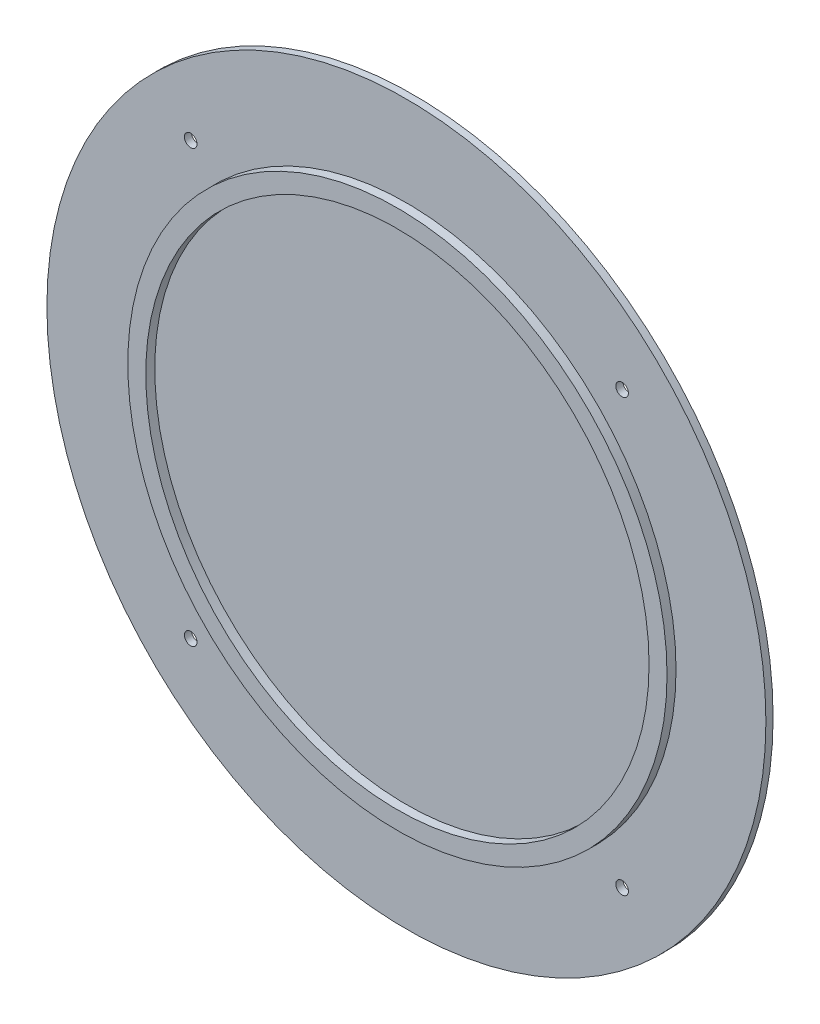
ISO-10303-21;
HEADER;
FILE_DESCRIPTION(('STEP AP214'),'2;1');
FILE_NAME('part.step','',(''),(''),'','','');
FILE_SCHEMA(('AUTOMOTIVE_DESIGN { 1 0 10303 214 1 1 1 1 }'));
ENDSEC;
DATA;
#1=APPLICATION_CONTEXT('core data for automotive mechanical design processes');
#2=APPLICATION_PROTOCOL_DEFINITION('international standard','automotive_design',2000,#1);
#3=PRODUCT_CONTEXT('',#1,'mechanical');
#4=PRODUCT('Part','Part','',(#3));
#5=PRODUCT_RELATED_PRODUCT_CATEGORY('part','',(#4));
#6=PRODUCT_DEFINITION_FORMATION('','',#4);
#7=PRODUCT_DEFINITION_CONTEXT('part definition',#1,'design');
#8=PRODUCT_DEFINITION('design','',#6,#7);
#9=PRODUCT_DEFINITION_SHAPE('','',#8);
#10=(LENGTH_UNIT() NAMED_UNIT(*) SI_UNIT(.MILLI.,.METRE.));
#11=(NAMED_UNIT(*) PLANE_ANGLE_UNIT() SI_UNIT($,.RADIAN.));
#12=(NAMED_UNIT(*) SI_UNIT($,.STERADIAN.) SOLID_ANGLE_UNIT());
#13=UNCERTAINTY_MEASURE_WITH_UNIT(LENGTH_MEASURE(1.E-05),#10,'distance_accuracy_value','');
#14=(GEOMETRIC_REPRESENTATION_CONTEXT(3) GLOBAL_UNCERTAINTY_ASSIGNED_CONTEXT((#13)) GLOBAL_UNIT_ASSIGNED_CONTEXT((#10,
#11,#12)) REPRESENTATION_CONTEXT('',''));
#15=CARTESIAN_POINT('',(0.,0.,0.));
#16=DIRECTION('',(0.,0.,1.));
#17=DIRECTION('',(1.,0.,0.));
#18=AXIS2_PLACEMENT_3D('',#15,#16,#17);
#19=CARTESIAN_POINT('',(0.,0.,0.4));
#20=DIRECTION('',(0.,0.,1.));
#21=DIRECTION('',(1.,0.,0.));
#22=AXIS2_PLACEMENT_3D('',#19,#20,#21);
#23=PLANE('',#22);
#24=CARTESIAN_POINT('',(-12.,-12.,0.4));
#25=DIRECTION('',(0.,0.,1.));
#26=DIRECTION('',(1.,0.,0.));
#27=AXIS2_PLACEMENT_3D('',#24,#25,#26);
#28=CIRCLE('',#27,0.349999999999999);
#29=CARTESIAN_POINT('',(-11.65,-12.,0.4));
#30=VERTEX_POINT('',#29);
#31=EDGE_CURVE('E65',#30,#30,#28,.T.);
#32=ORIENTED_EDGE('',*,*,#31,.F.);
#33=EDGE_LOOP('',(#32));
#34=FACE_BOUND('',#33,.T.);
#35=CARTESIAN_POINT('',(12.,-12.,0.4));
#36=DIRECTION('',(0.,0.,1.));
#37=DIRECTION('',(-1.,0.,0.));
#38=AXIS2_PLACEMENT_3D('',#35,#36,#37);
#39=CIRCLE('',#38,0.349999999999999);
#40=CARTESIAN_POINT('',(11.65,-12.,0.4));
#41=VERTEX_POINT('',#40);
#42=EDGE_CURVE('E62',#41,#41,#39,.T.);
#43=ORIENTED_EDGE('',*,*,#42,.F.);
#44=EDGE_LOOP('',(#43));
#45=FACE_BOUND('',#44,.T.);
#46=CARTESIAN_POINT('',(-12.,12.,0.4));
#47=DIRECTION('',(0.,0.,1.));
#48=DIRECTION('',(-1.,0.,0.));
#49=AXIS2_PLACEMENT_3D('',#46,#47,#48);
#50=CIRCLE('',#49,0.349999999999999);
#51=CARTESIAN_POINT('',(-12.35,12.,0.4));
#52=VERTEX_POINT('',#51);
#53=EDGE_CURVE('E59',#52,#52,#50,.T.);
#54=ORIENTED_EDGE('',*,*,#53,.F.);
#55=EDGE_LOOP('',(#54));
#56=FACE_BOUND('',#55,.T.);
#57=CARTESIAN_POINT('',(12.,12.,0.4));
#58=DIRECTION('',(0.,0.,1.));
#59=DIRECTION('',(1.,0.,0.));
#60=AXIS2_PLACEMENT_3D('',#57,#58,#59);
#61=CIRCLE('',#60,0.349999999999999);
#62=CARTESIAN_POINT('',(12.35,12.,0.4));
#63=VERTEX_POINT('',#62);
#64=EDGE_CURVE('E51',#63,#63,#61,.T.);
#65=ORIENTED_EDGE('',*,*,#64,.F.);
#66=EDGE_LOOP('',(#65));
#67=FACE_BOUND('',#66,.T.);
#68=CARTESIAN_POINT('',(0.,0.,0.4));
#69=DIRECTION('',(0.,0.,1.));
#70=DIRECTION('',(1.,0.,0.));
#71=AXIS2_PLACEMENT_3D('',#68,#69,#70);
#72=CIRCLE('',#71,20.);
#73=CARTESIAN_POINT('',(20.,0.,0.4));
#74=VERTEX_POINT('',#73);
#75=EDGE_CURVE('E39',#74,#74,#72,.T.);
#76=ORIENTED_EDGE('',*,*,#75,.T.);
#77=EDGE_LOOP('',(#76));
#78=FACE_BOUND('',#77,.T.);
#79=CARTESIAN_POINT('',(0.,0.,0.4));
#80=DIRECTION('',(0.,0.,1.));
#81=DIRECTION('',(1.,0.,0.));
#82=AXIS2_PLACEMENT_3D('',#79,#80,#81);
#83=CIRCLE('',#82,15.);
#84=CARTESIAN_POINT('',(15.,0.,0.4));
#85=VERTEX_POINT('',#84);
#86=EDGE_CURVE('E76',#85,#85,#83,.T.);
#87=ORIENTED_EDGE('',*,*,#86,.F.);
#88=EDGE_LOOP('',(#87));
#89=FACE_BOUND('',#88,.T.);
#90=ADVANCED_FACE('F32',(#34,#45,#56,#67,#78,#89),#23,.T.);
#91=CARTESIAN_POINT('',(0.,0.,0.4));
#92=DIRECTION('',(0.,0.,-1.));
#93=DIRECTION('',(-1.,0.,0.));
#94=AXIS2_PLACEMENT_3D('',#91,#92,#93);
#95=CYLINDRICAL_SURFACE('',#94,20.);
#96=ORIENTED_EDGE('',*,*,#75,.F.);
#97=EDGE_LOOP('',(#96));
#98=FACE_BOUND('',#97,.T.);
#99=CARTESIAN_POINT('',(0.,0.,0.));
#100=DIRECTION('',(0.,0.,1.));
#101=DIRECTION('',(1.,0.,0.));
#102=AXIS2_PLACEMENT_3D('',#99,#100,#101);
#103=CIRCLE('',#102,20.);
#104=CARTESIAN_POINT('',(20.,0.,0.));
#105=VERTEX_POINT('',#104);
#106=EDGE_CURVE('E43',#105,#105,#103,.T.);
#107=ORIENTED_EDGE('',*,*,#106,.T.);
#108=EDGE_LOOP('',(#107));
#109=FACE_BOUND('',#108,.T.);
#110=ADVANCED_FACE('F34',(#98,#109),#95,.T.);
#111=CARTESIAN_POINT('',(0.,0.,0.));
#112=DIRECTION('',(0.,0.,1.));
#113=DIRECTION('',(1.,0.,0.));
#114=AXIS2_PLACEMENT_3D('',#111,#112,#113);
#115=PLANE('',#114);
#116=CARTESIAN_POINT('',(-12.,-12.,0.));
#117=DIRECTION('',(0.,0.,1.));
#118=DIRECTION('',(1.,0.,0.));
#119=AXIS2_PLACEMENT_3D('',#116,#117,#118);
#120=CIRCLE('',#119,0.349999999999999);
#121=CARTESIAN_POINT('',(-11.65,-12.,0.));
#122=VERTEX_POINT('',#121);
#123=EDGE_CURVE('E63',#122,#122,#120,.T.);
#124=ORIENTED_EDGE('',*,*,#123,.T.);
#125=EDGE_LOOP('',(#124));
#126=FACE_BOUND('',#125,.T.);
#127=CARTESIAN_POINT('',(12.,-12.,0.));
#128=DIRECTION('',(0.,0.,1.));
#129=DIRECTION('',(1.,0.,0.));
#130=AXIS2_PLACEMENT_3D('',#127,#128,#129);
#131=CIRCLE('',#130,0.349999999999999);
#132=CARTESIAN_POINT('',(12.35,-12.,0.));
#133=VERTEX_POINT('',#132);
#134=EDGE_CURVE('E60',#133,#133,#131,.T.);
#135=ORIENTED_EDGE('',*,*,#134,.T.);
#136=EDGE_LOOP('',(#135));
#137=FACE_BOUND('',#136,.T.);
#138=CARTESIAN_POINT('',(-12.,12.,0.));
#139=DIRECTION('',(0.,0.,1.));
#140=DIRECTION('',(1.,0.,0.));
#141=AXIS2_PLACEMENT_3D('',#138,#139,#140);
#142=CIRCLE('',#141,0.349999999999999);
#143=CARTESIAN_POINT('',(-11.65,12.,0.));
#144=VERTEX_POINT('',#143);
#145=EDGE_CURVE('E56',#144,#144,#142,.T.);
#146=ORIENTED_EDGE('',*,*,#145,.T.);
#147=EDGE_LOOP('',(#146));
#148=FACE_BOUND('',#147,.T.);
#149=CARTESIAN_POINT('',(12.,12.,0.));
#150=DIRECTION('',(0.,0.,1.));
#151=DIRECTION('',(1.,0.,0.));
#152=AXIS2_PLACEMENT_3D('',#149,#150,#151);
#153=CIRCLE('',#152,0.349999999999999);
#154=CARTESIAN_POINT('',(12.35,12.,0.));
#155=VERTEX_POINT('',#154);
#156=EDGE_CURVE('E48',#155,#155,#153,.T.);
#157=ORIENTED_EDGE('',*,*,#156,.T.);
#158=EDGE_LOOP('',(#157));
#159=FACE_BOUND('',#158,.T.);
#160=ORIENTED_EDGE('',*,*,#106,.F.);
#161=EDGE_LOOP('',(#160));
#162=FACE_BOUND('',#161,.T.);
#163=ADVANCED_FACE('F126',(#126,#137,#148,#159,#162),#115,.F.);
#164=CARTESIAN_POINT('',(12.,12.,-9.6));
#165=DIRECTION('',(0.,0.,1.));
#166=DIRECTION('',(1.,0.,0.));
#167=AXIS2_PLACEMENT_3D('',#164,#165,#166);
#168=CYLINDRICAL_SURFACE('',#167,0.349999999999999);
#169=ORIENTED_EDGE('',*,*,#64,.T.);
#170=EDGE_LOOP('',(#169));
#171=FACE_BOUND('',#170,.T.);
#172=ORIENTED_EDGE('',*,*,#156,.F.);
#173=EDGE_LOOP('',(#172));
#174=FACE_BOUND('',#173,.T.);
#175=ADVANCED_FACE('F124',(#171,#174),#168,.F.);
#176=CARTESIAN_POINT('',(-12.,12.,-9.6));
#177=DIRECTION('',(0.,0.,1.));
#178=DIRECTION('',(1.,0.,0.));
#179=AXIS2_PLACEMENT_3D('',#176,#177,#178);
#180=CYLINDRICAL_SURFACE('',#179,0.349999999999999);
#181=ORIENTED_EDGE('',*,*,#53,.T.);
#182=EDGE_LOOP('',(#181));
#183=FACE_BOUND('',#182,.T.);
#184=ORIENTED_EDGE('',*,*,#145,.F.);
#185=EDGE_LOOP('',(#184));
#186=FACE_BOUND('',#185,.T.);
#187=ADVANCED_FACE('F82',(#183,#186),#180,.F.);
#188=CARTESIAN_POINT('',(12.,-12.,-9.6));
#189=DIRECTION('',(0.,0.,1.));
#190=DIRECTION('',(1.,0.,0.));
#191=AXIS2_PLACEMENT_3D('',#188,#189,#190);
#192=CYLINDRICAL_SURFACE('',#191,0.349999999999999);
#193=ORIENTED_EDGE('',*,*,#42,.T.);
#194=EDGE_LOOP('',(#193));
#195=FACE_BOUND('',#194,.T.);
#196=ORIENTED_EDGE('',*,*,#134,.F.);
#197=EDGE_LOOP('',(#196));
#198=FACE_BOUND('',#197,.T.);
#199=ADVANCED_FACE('F115',(#195,#198),#192,.F.);
#200=CARTESIAN_POINT('',(-12.,-12.,-9.6));
#201=DIRECTION('',(0.,0.,1.));
#202=DIRECTION('',(1.,0.,0.));
#203=AXIS2_PLACEMENT_3D('',#200,#201,#202);
#204=CYLINDRICAL_SURFACE('',#203,0.349999999999999);
#205=ORIENTED_EDGE('',*,*,#31,.T.);
#206=EDGE_LOOP('',(#205));
#207=FACE_BOUND('',#206,.T.);
#208=ORIENTED_EDGE('',*,*,#123,.F.);
#209=EDGE_LOOP('',(#208));
#210=FACE_BOUND('',#209,.T.);
#211=ADVANCED_FACE('F106',(#207,#210),#204,.F.);
#212=CARTESIAN_POINT('',(0.,0.,0.9));
#213=DIRECTION('',(0.,0.,1.));
#214=DIRECTION('',(1.,0.,0.));
#215=AXIS2_PLACEMENT_3D('',#212,#213,#214);
#216=PLANE('',#215);
#217=CARTESIAN_POINT('',(0.,0.,0.9));
#218=DIRECTION('',(0.,0.,1.));
#219=DIRECTION('',(1.,0.,0.));
#220=AXIS2_PLACEMENT_3D('',#217,#218,#219);
#221=CIRCLE('',#220,15.);
#222=CARTESIAN_POINT('',(15.,0.,0.9));
#223=VERTEX_POINT('',#222);
#224=EDGE_CURVE('E71',#223,#223,#221,.T.);
#225=ORIENTED_EDGE('',*,*,#224,.T.);
#226=EDGE_LOOP('',(#225));
#227=FACE_BOUND('',#226,.T.);
#228=CARTESIAN_POINT('',(0.,0.,0.9));
#229=DIRECTION('',(0.,0.,1.));
#230=DIRECTION('',(1.,0.,0.));
#231=AXIS2_PLACEMENT_3D('',#228,#229,#230);
#232=CIRCLE('',#231,14.);
#233=CARTESIAN_POINT('',(14.,0.,0.9));
#234=VERTEX_POINT('',#233);
#235=EDGE_CURVE('E96',#234,#234,#232,.T.);
#236=ORIENTED_EDGE('',*,*,#235,.F.);
#237=EDGE_LOOP('',(#236));
#238=FACE_BOUND('',#237,.T.);
#239=ADVANCED_FACE('F103',(#227,#238),#216,.T.);
#240=CARTESIAN_POINT('',(0.,0.,0.9));
#241=DIRECTION('',(0.,0.,-1.));
#242=DIRECTION('',(-1.,0.,0.));
#243=AXIS2_PLACEMENT_3D('',#240,#241,#242);
#244=CYLINDRICAL_SURFACE('',#243,15.);
#245=ORIENTED_EDGE('',*,*,#224,.F.);
#246=EDGE_LOOP('',(#245));
#247=FACE_BOUND('',#246,.T.);
#248=ORIENTED_EDGE('',*,*,#86,.T.);
#249=EDGE_LOOP('',(#248));
#250=FACE_BOUND('',#249,.T.);
#251=ADVANCED_FACE('F105',(#247,#250),#244,.T.);
#252=CARTESIAN_POINT('',(0.,0.,0.9));
#253=DIRECTION('',(0.,0.,-1.));
#254=DIRECTION('',(-1.,0.,0.));
#255=AXIS2_PLACEMENT_3D('',#252,#253,#254);
#256=CYLINDRICAL_SURFACE('',#255,14.);
#257=ORIENTED_EDGE('',*,*,#235,.T.);
#258=EDGE_LOOP('',(#257));
#259=FACE_BOUND('',#258,.T.);
#260=CARTESIAN_POINT('',(0.,0.,0.4));
#261=DIRECTION('',(0.,0.,1.));
#262=DIRECTION('',(1.,0.,0.));
#263=AXIS2_PLACEMENT_3D('',#260,#261,#262);
#264=CIRCLE('',#263,14.);
#265=CARTESIAN_POINT('',(14.,0.,0.4));
#266=VERTEX_POINT('',#265);
#267=EDGE_CURVE('E10',#266,#266,#264,.F.);
#268=ORIENTED_EDGE('',*,*,#267,.T.);
#269=EDGE_LOOP('',(#268));
#270=FACE_BOUND('',#269,.T.);
#271=ADVANCED_FACE('F101',(#259,#270),#256,.F.);
#272=ORIENTED_EDGE('',*,*,#267,.F.);
#273=EDGE_LOOP('',(#272));
#274=FACE_BOUND('',#273,.T.);
#275=ADVANCED_FACE('F89',(#274),#23,.T.);
#276=CLOSED_SHELL('',(#90,#110,#163,#175,#187,#199,#211,#239,#251,#271,#275));
#277=MANIFOLD_SOLID_BREP('B2',#276);
#278=ADVANCED_BREP_SHAPE_REPRESENTATION('',(#18,#277),#14);
#279=SHAPE_DEFINITION_REPRESENTATION(#9,#278);
ENDSEC;
END-ISO-10303-21;
